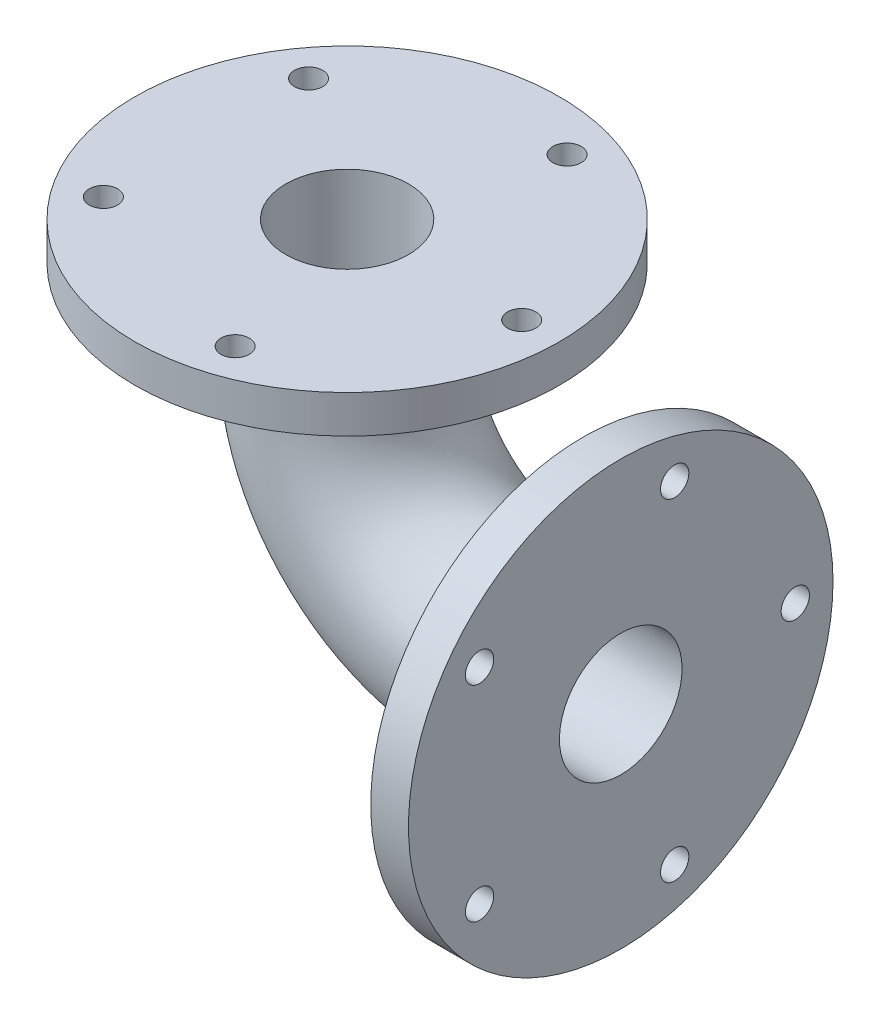
ISO-10303-21;
HEADER;
FILE_DESCRIPTION(('STEP AP214'),'2;1');
FILE_NAME('part.step','',(''),(''),'','','');
FILE_SCHEMA(('AUTOMOTIVE_DESIGN { 1 0 10303 214 1 1 1 1 }'));
ENDSEC;
DATA;
#1=APPLICATION_CONTEXT('core data for automotive mechanical design processes');
#2=APPLICATION_PROTOCOL_DEFINITION('international standard','automotive_design',2000,#1);
#3=PRODUCT_CONTEXT('',#1,'mechanical');
#4=PRODUCT('Part','Part','',(#3));
#5=PRODUCT_RELATED_PRODUCT_CATEGORY('part','',(#4));
#6=PRODUCT_DEFINITION_FORMATION('','',#4);
#7=PRODUCT_DEFINITION_CONTEXT('part definition',#1,'design');
#8=PRODUCT_DEFINITION('design','',#6,#7);
#9=PRODUCT_DEFINITION_SHAPE('','',#8);
#10=(LENGTH_UNIT() NAMED_UNIT(*) SI_UNIT(.MILLI.,.METRE.));
#11=(NAMED_UNIT(*) PLANE_ANGLE_UNIT() SI_UNIT($,.RADIAN.));
#12=(NAMED_UNIT(*) SI_UNIT($,.STERADIAN.) SOLID_ANGLE_UNIT());
#13=UNCERTAINTY_MEASURE_WITH_UNIT(LENGTH_MEASURE(1.E-05),#10,'distance_accuracy_value','');
#14=(GEOMETRIC_REPRESENTATION_CONTEXT(3) GLOBAL_UNCERTAINTY_ASSIGNED_CONTEXT((#13)) GLOBAL_UNIT_ASSIGNED_CONTEXT((#10,
#11,#12)) REPRESENTATION_CONTEXT('',''));
#15=CARTESIAN_POINT('',(0.,0.,0.));
#16=DIRECTION('',(0.,0.,1.));
#17=DIRECTION('',(1.,0.,0.));
#18=AXIS2_PLACEMENT_3D('',#15,#16,#17);
#19=CARTESIAN_POINT('',(-145.,90.,0.));
#20=DIRECTION('',(0.,1.,0.));
#21=DIRECTION('',(0.,0.,1.));
#22=AXIS2_PLACEMENT_3D('',#19,#20,#21);
#23=CYLINDRICAL_SURFACE('',#22,48.5);
#24=CARTESIAN_POINT('',(-145.,90.,0.));
#25=DIRECTION('',(0.,-1.,0.));
#26=DIRECTION('',(0.,0.,-1.));
#27=AXIS2_PLACEMENT_3D('',#24,#25,#26);
#28=CIRCLE('',#27,48.5);
#29=CARTESIAN_POINT('',(-193.5,90.,0.));
#30=VERTEX_POINT('',#29);
#31=EDGE_CURVE('E42',#30,#30,#28,.T.);
#32=ORIENTED_EDGE('',*,*,#31,.F.);
#33=EDGE_LOOP('',(#32));
#34=FACE_BOUND('',#33,.T.);
#35=CARTESIAN_POINT('',(-145.,130.,0.));
#36=DIRECTION('',(0.,1.,0.));
#37=DIRECTION('',(0.,0.,1.));
#38=AXIS2_PLACEMENT_3D('',#35,#36,#37);
#39=CIRCLE('',#38,48.5);
#40=CARTESIAN_POINT('',(-145.,130.,48.5));
#41=VERTEX_POINT('',#40);
#42=EDGE_CURVE('E10',#41,#41,#39,.T.);
#43=ORIENTED_EDGE('',*,*,#42,.F.);
#44=EDGE_LOOP('',(#43));
#45=FACE_BOUND('',#44,.T.);
#46=ADVANCED_FACE('F31',(#34,#45),#23,.T.);
#47=CARTESIAN_POINT('',(0.,0.,0.));
#48=DIRECTION('',(-1.,0.,0.));
#49=DIRECTION('',(0.,0.,1.));
#50=AXIS2_PLACEMENT_3D('',#47,#48,#49);
#51=CYLINDRICAL_SURFACE('',#50,48.5);
#52=CARTESIAN_POINT('',(-55.,0.,0.));
#53=DIRECTION('',(1.,0.,0.));
#54=DIRECTION('',(0.,0.,-1.));
#55=AXIS2_PLACEMENT_3D('',#52,#53,#54);
#56=CIRCLE('',#55,48.5);
#57=CARTESIAN_POINT('',(-55.,-48.5,0.));
#58=VERTEX_POINT('',#57);
#59=EDGE_CURVE('E46',#58,#58,#56,.T.);
#60=ORIENTED_EDGE('',*,*,#59,.T.);
#61=EDGE_LOOP('',(#60));
#62=FACE_BOUND('',#61,.T.);
#63=CARTESIAN_POINT('',(-20.,0.,0.));
#64=DIRECTION('',(1.,0.,0.));
#65=DIRECTION('',(0.,0.,-1.));
#66=AXIS2_PLACEMENT_3D('',#63,#64,#65);
#67=CIRCLE('',#66,48.5);
#68=CARTESIAN_POINT('',(-20.,0.,-48.5));
#69=VERTEX_POINT('',#68);
#70=EDGE_CURVE('E38',#69,#69,#67,.T.);
#71=ORIENTED_EDGE('',*,*,#70,.F.);
#72=EDGE_LOOP('',(#71));
#73=FACE_BOUND('',#72,.T.);
#74=ADVANCED_FACE('F166',(#62,#73),#51,.T.);
#75=CARTESIAN_POINT('',(-55.,90.,0.));
#76=DIRECTION('',(0.,0.,-1.));
#77=DIRECTION('',(-1.,0.,0.));
#78=AXIS2_PLACEMENT_3D('',#75,#76,#77);
#79=TOROIDAL_SURFACE('',#78,90.,48.5);
#80=CARTESIAN_POINT('',(-55.,90.,0.));
#81=DIRECTION('',(0.,0.,-1.));
#82=DIRECTION('',(-1.,0.,0.));
#83=AXIS2_PLACEMENT_3D('',#80,#81,#82);
#84=CIRCLE('',#83,138.5);
#85=EDGE_CURVE('',#58,#30,#84,.T.);
#86=ORIENTED_EDGE('',*,*,#59,.F.);
#87=ORIENTED_EDGE('',*,*,#31,.T.);
#88=ORIENTED_EDGE('',*,*,#85,.T.);
#89=ORIENTED_EDGE('',*,*,#85,.F.);
#90=EDGE_LOOP('',(#86,#88,#87,#89));
#91=FACE_BOUND('',#90,.T.);
#92=ADVANCED_FACE('F157',(#91),#79,.T.);
#93=CARTESIAN_POINT('',(-20.,0.,0.));
#94=DIRECTION('',(1.,0.,0.));
#95=DIRECTION('',(0.,0.,-1.));
#96=AXIS2_PLACEMENT_3D('',#93,#94,#95);
#97=CYLINDRICAL_SURFACE('',#96,112.5);
#98=CARTESIAN_POINT('',(-20.,0.,0.));
#99=DIRECTION('',(1.,0.,0.));
#100=DIRECTION('',(0.,0.,-1.));
#101=AXIS2_PLACEMENT_3D('',#98,#99,#100);
#102=CIRCLE('',#101,112.5);
#103=CARTESIAN_POINT('',(-20.,0.,-112.5));
#104=VERTEX_POINT('',#103);
#105=EDGE_CURVE('E51',#104,#104,#102,.T.);
#106=ORIENTED_EDGE('',*,*,#105,.T.);
#107=EDGE_LOOP('',(#106));
#108=FACE_BOUND('',#107,.T.);
#109=CARTESIAN_POINT('',(0.,0.,0.));
#110=DIRECTION('',(1.,0.,0.));
#111=DIRECTION('',(0.,0.,-1.));
#112=AXIS2_PLACEMENT_3D('',#109,#110,#111);
#113=CIRCLE('',#112,112.5);
#114=CARTESIAN_POINT('',(0.,0.,-112.5));
#115=VERTEX_POINT('',#114);
#116=EDGE_CURVE('E52',#115,#115,#113,.T.);
#117=ORIENTED_EDGE('',*,*,#116,.F.);
#118=EDGE_LOOP('',(#117));
#119=FACE_BOUND('',#118,.T.);
#120=ADVANCED_FACE('F155',(#108,#119),#97,.T.);
#121=CARTESIAN_POINT('',(-20.,0.,0.));
#122=DIRECTION('',(1.,0.,0.));
#123=DIRECTION('',(0.,0.,-1.));
#124=AXIS2_PLACEMENT_3D('',#121,#122,#123);
#125=PLANE('',#124);
#126=CARTESIAN_POINT('',(-20.,-87.9727277573018,-28.5840719796824));
#127=DIRECTION('',(1.,0.,0.));
#128=DIRECTION('',(0.,0.,-1.));
#129=AXIS2_PLACEMENT_3D('',#126,#127,#128);
#130=CIRCLE('',#129,7.50000000000002);
#131=CARTESIAN_POINT('',(-20.,-87.9727277573018,-36.0840719796824));
#132=VERTEX_POINT('',#131);
#133=EDGE_CURVE('E111',#132,#132,#130,.T.);
#134=ORIENTED_EDGE('',*,*,#133,.T.);
#135=EDGE_LOOP('',(#134));
#136=FACE_BOUND('',#135,.T.);
#137=CARTESIAN_POINT('',(-20.,-54.3701358370533,74.8340719796829));
#138=DIRECTION('',(1.,0.,0.));
#139=DIRECTION('',(0.,0.,-1.));
#140=AXIS2_PLACEMENT_3D('',#137,#138,#139);
#141=CIRCLE('',#140,7.50000000000001);
#142=CARTESIAN_POINT('',(-20.,-54.3701358370533,67.3340719796829));
#143=VERTEX_POINT('',#142);
#144=EDGE_CURVE('E114',#143,#143,#141,.T.);
#145=ORIENTED_EDGE('',*,*,#144,.T.);
#146=EDGE_LOOP('',(#145));
#147=FACE_BOUND('',#146,.T.);
#148=CARTESIAN_POINT('',(-20.,54.3701358370544,74.8340719796822));
#149=DIRECTION('',(1.,0.,0.));
#150=DIRECTION('',(0.,0.,-1.));
#151=AXIS2_PLACEMENT_3D('',#148,#149,#150);
#152=CIRCLE('',#151,7.50000000000001);
#153=CARTESIAN_POINT('',(-20.,54.3701358370544,67.3340719796822));
#154=VERTEX_POINT('',#153);
#155=EDGE_CURVE('E117',#154,#154,#152,.T.);
#156=ORIENTED_EDGE('',*,*,#155,.T.);
#157=EDGE_LOOP('',(#156));
#158=FACE_BOUND('',#157,.T.);
#159=CARTESIAN_POINT('',(-20.,87.9727277573014,-28.5840719796836));
#160=DIRECTION('',(1.,0.,0.));
#161=DIRECTION('',(0.,0.,-1.));
#162=AXIS2_PLACEMENT_3D('',#159,#160,#161);
#163=CIRCLE('',#162,7.50000000000001);
#164=CARTESIAN_POINT('',(-20.,87.9727277573014,-36.0840719796836));
#165=VERTEX_POINT('',#164);
#166=EDGE_CURVE('E120',#165,#165,#163,.T.);
#167=ORIENTED_EDGE('',*,*,#166,.T.);
#168=EDGE_LOOP('',(#167));
#169=FACE_BOUND('',#168,.T.);
#170=CARTESIAN_POINT('',(-20.,0.,-92.5));
#171=DIRECTION('',(1.,0.,0.));
#172=DIRECTION('',(0.,0.,-1.));
#173=AXIS2_PLACEMENT_3D('',#170,#171,#172);
#174=CIRCLE('',#173,7.50000000000001);
#175=CARTESIAN_POINT('',(-20.,0.,-100.));
#176=VERTEX_POINT('',#175);
#177=EDGE_CURVE('E98',#176,#176,#174,.T.);
#178=ORIENTED_EDGE('',*,*,#177,.T.);
#179=EDGE_LOOP('',(#178));
#180=FACE_BOUND('',#179,.T.);
#181=ORIENTED_EDGE('',*,*,#70,.T.);
#182=EDGE_LOOP('',(#181));
#183=FACE_BOUND('',#182,.T.);
#184=ORIENTED_EDGE('',*,*,#105,.F.);
#185=EDGE_LOOP('',(#184));
#186=FACE_BOUND('',#185,.T.);
#187=ADVANCED_FACE('F142',(#136,#147,#158,#169,#180,#183,#186),#125,.F.);
#188=CARTESIAN_POINT('',(0.,0.,0.));
#189=DIRECTION('',(1.,0.,0.));
#190=DIRECTION('',(0.,0.,-1.));
#191=AXIS2_PLACEMENT_3D('',#188,#189,#190);
#192=PLANE('',#191);
#193=CARTESIAN_POINT('',(0.,-87.9727277573018,-28.5840719796824));
#194=DIRECTION('',(1.,0.,0.));
#195=DIRECTION('',(0.,0.,-1.));
#196=AXIS2_PLACEMENT_3D('',#193,#194,#195);
#197=CIRCLE('',#196,7.50000000000002);
#198=CARTESIAN_POINT('',(0.,-87.9727277573018,-36.0840719796824));
#199=VERTEX_POINT('',#198);
#200=EDGE_CURVE('E123',#199,#199,#197,.T.);
#201=ORIENTED_EDGE('',*,*,#200,.F.);
#202=EDGE_LOOP('',(#201));
#203=FACE_BOUND('',#202,.T.);
#204=CARTESIAN_POINT('',(0.,-54.3701358370533,74.8340719796829));
#205=DIRECTION('',(1.,0.,0.));
#206=DIRECTION('',(0.,0.,-1.));
#207=AXIS2_PLACEMENT_3D('',#204,#205,#206);
#208=CIRCLE('',#207,7.50000000000001);
#209=CARTESIAN_POINT('',(0.,-54.3701358370533,67.3340719796829));
#210=VERTEX_POINT('',#209);
#211=EDGE_CURVE('E130',#210,#210,#208,.T.);
#212=ORIENTED_EDGE('',*,*,#211,.F.);
#213=EDGE_LOOP('',(#212));
#214=FACE_BOUND('',#213,.T.);
#215=CARTESIAN_POINT('',(0.,54.3701358370544,74.8340719796822));
#216=DIRECTION('',(1.,0.,0.));
#217=DIRECTION('',(0.,0.,-1.));
#218=AXIS2_PLACEMENT_3D('',#215,#216,#217);
#219=CIRCLE('',#218,7.50000000000001);
#220=CARTESIAN_POINT('',(0.,54.3701358370544,67.3340719796822));
#221=VERTEX_POINT('',#220);
#222=EDGE_CURVE('E127',#221,#221,#219,.T.);
#223=ORIENTED_EDGE('',*,*,#222,.F.);
#224=EDGE_LOOP('',(#223));
#225=FACE_BOUND('',#224,.T.);
#226=CARTESIAN_POINT('',(0.,87.9727277573014,-28.5840719796836));
#227=DIRECTION('',(1.,0.,0.));
#228=DIRECTION('',(0.,0.,-1.));
#229=AXIS2_PLACEMENT_3D('',#226,#227,#228);
#230=CIRCLE('',#229,7.50000000000001);
#231=CARTESIAN_POINT('',(0.,87.9727277573014,-36.0840719796836));
#232=VERTEX_POINT('',#231);
#233=EDGE_CURVE('E124',#232,#232,#230,.T.);
#234=ORIENTED_EDGE('',*,*,#233,.F.);
#235=EDGE_LOOP('',(#234));
#236=FACE_BOUND('',#235,.T.);
#237=CARTESIAN_POINT('',(0.,0.,-92.5));
#238=DIRECTION('',(1.,0.,0.));
#239=DIRECTION('',(0.,0.,-1.));
#240=AXIS2_PLACEMENT_3D('',#237,#238,#239);
#241=CIRCLE('',#240,7.50000000000001);
#242=CARTESIAN_POINT('',(0.,0.,-100.));
#243=VERTEX_POINT('',#242);
#244=EDGE_CURVE('E108',#243,#243,#241,.T.);
#245=ORIENTED_EDGE('',*,*,#244,.F.);
#246=EDGE_LOOP('',(#245));
#247=FACE_BOUND('',#246,.T.);
#248=CARTESIAN_POINT('',(0.,0.,0.));
#249=DIRECTION('',(1.,0.,0.));
#250=DIRECTION('',(0.,0.,-1.));
#251=AXIS2_PLACEMENT_3D('',#248,#249,#250);
#252=CIRCLE('',#251,32.5);
#253=CARTESIAN_POINT('',(0.,0.,-32.5));
#254=VERTEX_POINT('',#253);
#255=EDGE_CURVE('E66',#254,#254,#252,.T.);
#256=ORIENTED_EDGE('',*,*,#255,.F.);
#257=EDGE_LOOP('',(#256));
#258=FACE_BOUND('',#257,.T.);
#259=ORIENTED_EDGE('',*,*,#116,.T.);
#260=EDGE_LOOP('',(#259));
#261=FACE_BOUND('',#260,.T.);
#262=ADVANCED_FACE('F33',(#203,#214,#225,#236,#247,#258,#261),#192,.T.);
#263=CARTESIAN_POINT('',(-145.,130.,0.));
#264=DIRECTION('',(0.,1.,0.));
#265=DIRECTION('',(0.,0.,1.));
#266=AXIS2_PLACEMENT_3D('',#263,#264,#265);
#267=CYLINDRICAL_SURFACE('',#266,112.5);
#268=CARTESIAN_POINT('',(-145.,130.,0.));
#269=DIRECTION('',(0.,1.,0.));
#270=DIRECTION('',(0.,0.,1.));
#271=AXIS2_PLACEMENT_3D('',#268,#269,#270);
#272=CIRCLE('',#271,112.5);
#273=CARTESIAN_POINT('',(-145.,130.,112.5));
#274=VERTEX_POINT('',#273);
#275=EDGE_CURVE('E55',#274,#274,#272,.T.);
#276=ORIENTED_EDGE('',*,*,#275,.T.);
#277=EDGE_LOOP('',(#276));
#278=FACE_BOUND('',#277,.T.);
#279=CARTESIAN_POINT('',(-145.,150.,0.));
#280=DIRECTION('',(0.,1.,0.));
#281=DIRECTION('',(0.,0.,1.));
#282=AXIS2_PLACEMENT_3D('',#279,#280,#281);
#283=CIRCLE('',#282,112.5);
#284=CARTESIAN_POINT('',(-145.,150.,112.5));
#285=VERTEX_POINT('',#284);
#286=EDGE_CURVE('E58',#285,#285,#283,.T.);
#287=ORIENTED_EDGE('',*,*,#286,.F.);
#288=EDGE_LOOP('',(#287));
#289=FACE_BOUND('',#288,.T.);
#290=ADVANCED_FACE('F141',(#278,#289),#267,.T.);
#291=CARTESIAN_POINT('',(-145.,130.,0.));
#292=DIRECTION('',(0.,1.,0.));
#293=DIRECTION('',(0.,0.,1.));
#294=AXIS2_PLACEMENT_3D('',#291,#292,#293);
#295=PLANE('',#294);
#296=CARTESIAN_POINT('',(-116.415928020316,130.,-87.9727277573014));
#297=DIRECTION('',(0.,1.,0.));
#298=DIRECTION('',(0.,0.,1.));
#299=AXIS2_PLACEMENT_3D('',#296,#297,#298);
#300=CIRCLE('',#299,7.49999999999999);
#301=CARTESIAN_POINT('',(-116.415928020316,130.,-80.4727277573014));
#302=VERTEX_POINT('',#301);
#303=EDGE_CURVE('E81',#302,#302,#300,.T.);
#304=ORIENTED_EDGE('',*,*,#303,.T.);
#305=EDGE_LOOP('',(#304));
#306=FACE_BOUND('',#305,.T.);
#307=CARTESIAN_POINT('',(-52.5,130.,0.));
#308=DIRECTION('',(0.,1.,0.));
#309=DIRECTION('',(0.,0.,1.));
#310=AXIS2_PLACEMENT_3D('',#307,#308,#309);
#311=CIRCLE('',#310,7.5);
#312=CARTESIAN_POINT('',(-52.5,130.,7.5));
#313=VERTEX_POINT('',#312);
#314=EDGE_CURVE('E84',#313,#313,#311,.T.);
#315=ORIENTED_EDGE('',*,*,#314,.T.);
#316=EDGE_LOOP('',(#315));
#317=FACE_BOUND('',#316,.T.);
#318=CARTESIAN_POINT('',(-116.415928020318,130.,87.9727277573018));
#319=DIRECTION('',(0.,1.,0.));
#320=DIRECTION('',(0.,0.,1.));
#321=AXIS2_PLACEMENT_3D('',#318,#319,#320);
#322=CIRCLE('',#321,7.50000000000001);
#323=CARTESIAN_POINT('',(-116.415928020318,130.,95.4727277573018));
#324=VERTEX_POINT('',#323);
#325=EDGE_CURVE('E87',#324,#324,#322,.T.);
#326=ORIENTED_EDGE('',*,*,#325,.T.);
#327=EDGE_LOOP('',(#326));
#328=FACE_BOUND('',#327,.T.);
#329=CARTESIAN_POINT('',(-219.834071979683,130.,54.3701358370533));
#330=DIRECTION('',(0.,1.,0.));
#331=DIRECTION('',(0.,0.,1.));
#332=AXIS2_PLACEMENT_3D('',#329,#330,#331);
#333=CIRCLE('',#332,7.5);
#334=CARTESIAN_POINT('',(-219.834071979683,130.,61.8701358370533));
#335=VERTEX_POINT('',#334);
#336=EDGE_CURVE('E90',#335,#335,#333,.T.);
#337=ORIENTED_EDGE('',*,*,#336,.T.);
#338=EDGE_LOOP('',(#337));
#339=FACE_BOUND('',#338,.T.);
#340=CARTESIAN_POINT('',(-219.834071979682,130.,-54.3701358370544));
#341=DIRECTION('',(0.,1.,0.));
#342=DIRECTION('',(0.,0.,1.));
#343=AXIS2_PLACEMENT_3D('',#340,#341,#342);
#344=CIRCLE('',#343,7.50000000000002);
#345=CARTESIAN_POINT('',(-219.834071979682,130.,-46.8701358370544));
#346=VERTEX_POINT('',#345);
#347=EDGE_CURVE('E73',#346,#346,#344,.T.);
#348=ORIENTED_EDGE('',*,*,#347,.T.);
#349=EDGE_LOOP('',(#348));
#350=FACE_BOUND('',#349,.T.);
#351=ORIENTED_EDGE('',*,*,#42,.T.);
#352=EDGE_LOOP('',(#351));
#353=FACE_BOUND('',#352,.T.);
#354=ORIENTED_EDGE('',*,*,#275,.F.);
#355=EDGE_LOOP('',(#354));
#356=FACE_BOUND('',#355,.T.);
#357=ADVANCED_FACE('F182',(#306,#317,#328,#339,#350,#353,#356),#295,.F.);
#358=CARTESIAN_POINT('',(-145.,150.,0.));
#359=DIRECTION('',(0.,-1.,0.));
#360=DIRECTION('',(0.,0.,-1.));
#361=AXIS2_PLACEMENT_3D('',#358,#359,#360);
#362=PLANE('',#361);
#363=CARTESIAN_POINT('',(-116.415928020316,150.,-87.9727277573014));
#364=DIRECTION('',(0.,1.,0.));
#365=DIRECTION('',(0.,0.,1.));
#366=AXIS2_PLACEMENT_3D('',#363,#364,#365);
#367=CIRCLE('',#366,7.49999999999999);
#368=CARTESIAN_POINT('',(-116.415928020316,150.,-80.4727277573014));
#369=VERTEX_POINT('',#368);
#370=EDGE_CURVE('E93',#369,#369,#367,.T.);
#371=ORIENTED_EDGE('',*,*,#370,.F.);
#372=EDGE_LOOP('',(#371));
#373=FACE_BOUND('',#372,.T.);
#374=CARTESIAN_POINT('',(-52.5,150.,0.));
#375=DIRECTION('',(0.,1.,0.));
#376=DIRECTION('',(0.,0.,1.));
#377=AXIS2_PLACEMENT_3D('',#374,#375,#376);
#378=CIRCLE('',#377,7.5);
#379=CARTESIAN_POINT('',(-52.5,150.,7.5));
#380=VERTEX_POINT('',#379);
#381=EDGE_CURVE('E101',#380,#380,#378,.T.);
#382=ORIENTED_EDGE('',*,*,#381,.F.);
#383=EDGE_LOOP('',(#382));
#384=FACE_BOUND('',#383,.T.);
#385=CARTESIAN_POINT('',(-116.415928020318,150.,87.9727277573018));
#386=DIRECTION('',(0.,1.,0.));
#387=DIRECTION('',(0.,0.,1.));
#388=AXIS2_PLACEMENT_3D('',#385,#386,#387);
#389=CIRCLE('',#388,7.50000000000001);
#390=CARTESIAN_POINT('',(-116.415928020318,150.,95.4727277573018));
#391=VERTEX_POINT('',#390);
#392=EDGE_CURVE('E97',#391,#391,#389,.T.);
#393=ORIENTED_EDGE('',*,*,#392,.F.);
#394=EDGE_LOOP('',(#393));
#395=FACE_BOUND('',#394,.T.);
#396=CARTESIAN_POINT('',(-219.834071979683,150.,54.3701358370533));
#397=DIRECTION('',(0.,1.,0.));
#398=DIRECTION('',(0.,0.,1.));
#399=AXIS2_PLACEMENT_3D('',#396,#397,#398);
#400=CIRCLE('',#399,7.5);
#401=CARTESIAN_POINT('',(-219.834071979683,150.,61.8701358370533));
#402=VERTEX_POINT('',#401);
#403=EDGE_CURVE('E94',#402,#402,#400,.T.);
#404=ORIENTED_EDGE('',*,*,#403,.F.);
#405=EDGE_LOOP('',(#404));
#406=FACE_BOUND('',#405,.T.);
#407=CARTESIAN_POINT('',(-219.834071979682,150.,-54.3701358370544));
#408=DIRECTION('',(0.,1.,0.));
#409=DIRECTION('',(0.,0.,1.));
#410=AXIS2_PLACEMENT_3D('',#407,#408,#409);
#411=CIRCLE('',#410,7.50000000000002);
#412=CARTESIAN_POINT('',(-219.834071979682,150.,-46.8701358370544));
#413=VERTEX_POINT('',#412);
#414=EDGE_CURVE('E78',#413,#413,#411,.T.);
#415=ORIENTED_EDGE('',*,*,#414,.F.);
#416=EDGE_LOOP('',(#415));
#417=FACE_BOUND('',#416,.T.);
#418=CARTESIAN_POINT('',(-145.,150.,0.));
#419=DIRECTION('',(0.,-1.,0.));
#420=DIRECTION('',(0.,0.,-1.));
#421=AXIS2_PLACEMENT_3D('',#418,#419,#420);
#422=CIRCLE('',#421,32.5);
#423=CARTESIAN_POINT('',(-145.,150.,-32.5));
#424=VERTEX_POINT('',#423);
#425=EDGE_CURVE('E61',#424,#424,#422,.T.);
#426=ORIENTED_EDGE('',*,*,#425,.T.);
#427=EDGE_LOOP('',(#426));
#428=FACE_BOUND('',#427,.T.);
#429=ORIENTED_EDGE('',*,*,#286,.T.);
#430=EDGE_LOOP('',(#429));
#431=FACE_BOUND('',#430,.T.);
#432=ADVANCED_FACE('F179',(#373,#384,#395,#406,#417,#428,#431),#362,.F.);
#433=CARTESIAN_POINT('',(5.,0.,0.));
#434=DIRECTION('',(-1.,0.,0.));
#435=DIRECTION('',(0.,0.,1.));
#436=AXIS2_PLACEMENT_3D('',#433,#434,#435);
#437=CYLINDRICAL_SURFACE('',#436,32.5);
#438=CARTESIAN_POINT('',(-55.,0.,0.));
#439=DIRECTION('',(1.,0.,0.));
#440=DIRECTION('',(0.,0.,-1.));
#441=AXIS2_PLACEMENT_3D('',#438,#439,#440);
#442=CIRCLE('',#441,32.5);
#443=CARTESIAN_POINT('',(-55.,-32.5,0.));
#444=VERTEX_POINT('',#443);
#445=EDGE_CURVE('E70',#444,#444,#442,.T.);
#446=ORIENTED_EDGE('',*,*,#445,.F.);
#447=EDGE_LOOP('',(#446));
#448=FACE_BOUND('',#447,.T.);
#449=ORIENTED_EDGE('',*,*,#255,.T.);
#450=EDGE_LOOP('',(#449));
#451=FACE_BOUND('',#450,.T.);
#452=ADVANCED_FACE('F181',(#448,#451),#437,.F.);
#453=CARTESIAN_POINT('',(-55.,90.,0.));
#454=DIRECTION('',(0.,0.,-1.));
#455=DIRECTION('',(-1.,0.,0.));
#456=AXIS2_PLACEMENT_3D('',#453,#454,#455);
#457=TOROIDAL_SURFACE('',#456,90.,32.5);
#458=CARTESIAN_POINT('',(-145.,90.,0.));
#459=DIRECTION('',(0.,-1.,0.));
#460=DIRECTION('',(0.,0.,-1.));
#461=AXIS2_PLACEMENT_3D('',#458,#459,#460);
#462=CIRCLE('',#461,32.5);
#463=CARTESIAN_POINT('',(-177.5,90.,0.));
#464=VERTEX_POINT('',#463);
#465=EDGE_CURVE('E69',#464,#464,#462,.T.);
#466=CARTESIAN_POINT('',(-55.,90.,0.));
#467=DIRECTION('',(0.,0.,-1.));
#468=DIRECTION('',(-1.,0.,0.));
#469=AXIS2_PLACEMENT_3D('',#466,#467,#468);
#470=CIRCLE('',#469,122.5);
#471=EDGE_CURVE('',#444,#464,#470,.T.);
#472=ORIENTED_EDGE('',*,*,#445,.T.);
#473=ORIENTED_EDGE('',*,*,#465,.F.);
#474=ORIENTED_EDGE('',*,*,#471,.T.);
#475=ORIENTED_EDGE('',*,*,#471,.F.);
#476=EDGE_LOOP('',(#472,#474,#473,#475));
#477=FACE_BOUND('',#476,.T.);
#478=ADVANCED_FACE('F188',(#477),#457,.F.);
#479=CARTESIAN_POINT('',(-145.,90.,0.));
#480=DIRECTION('',(0.,1.,0.));
#481=DIRECTION('',(0.,0.,1.));
#482=AXIS2_PLACEMENT_3D('',#479,#480,#481);
#483=CYLINDRICAL_SURFACE('',#482,32.5);
#484=ORIENTED_EDGE('',*,*,#425,.F.);
#485=EDGE_LOOP('',(#484));
#486=FACE_BOUND('',#485,.T.);
#487=ORIENTED_EDGE('',*,*,#465,.T.);
#488=EDGE_LOOP('',(#487));
#489=FACE_BOUND('',#488,.T.);
#490=ADVANCED_FACE('F191',(#486,#489),#483,.F.);
#491=CARTESIAN_POINT('',(-219.834071979682,120.,-54.3701358370544));
#492=DIRECTION('',(0.,1.,0.));
#493=DIRECTION('',(0.,0.,1.));
#494=AXIS2_PLACEMENT_3D('',#491,#492,#493);
#495=CYLINDRICAL_SURFACE('',#494,7.50000000000002);
#496=ORIENTED_EDGE('',*,*,#414,.T.);
#497=EDGE_LOOP('',(#496));
#498=FACE_BOUND('',#497,.T.);
#499=ORIENTED_EDGE('',*,*,#347,.F.);
#500=EDGE_LOOP('',(#499));
#501=FACE_BOUND('',#500,.T.);
#502=ADVANCED_FACE('F217',(#498,#501),#495,.F.);
#503=CARTESIAN_POINT('',(-219.834071979683,120.,54.3701358370533));
#504=DIRECTION('',(0.,1.,0.));
#505=DIRECTION('',(0.,0.,1.));
#506=AXIS2_PLACEMENT_3D('',#503,#504,#505);
#507=CYLINDRICAL_SURFACE('',#506,7.5);
#508=ORIENTED_EDGE('',*,*,#403,.T.);
#509=EDGE_LOOP('',(#508));
#510=FACE_BOUND('',#509,.T.);
#511=ORIENTED_EDGE('',*,*,#336,.F.);
#512=EDGE_LOOP('',(#511));
#513=FACE_BOUND('',#512,.T.);
#514=ADVANCED_FACE('F223',(#510,#513),#507,.F.);
#515=CARTESIAN_POINT('',(-116.415928020318,120.,87.9727277573018));
#516=DIRECTION('',(0.,1.,0.));
#517=DIRECTION('',(0.,0.,1.));
#518=AXIS2_PLACEMENT_3D('',#515,#516,#517);
#519=CYLINDRICAL_SURFACE('',#518,7.50000000000001);
#520=ORIENTED_EDGE('',*,*,#392,.T.);
#521=EDGE_LOOP('',(#520));
#522=FACE_BOUND('',#521,.T.);
#523=ORIENTED_EDGE('',*,*,#325,.F.);
#524=EDGE_LOOP('',(#523));
#525=FACE_BOUND('',#524,.T.);
#526=ADVANCED_FACE('F227',(#522,#525),#519,.F.);
#527=CARTESIAN_POINT('',(-52.5,120.,0.));
#528=DIRECTION('',(0.,1.,0.));
#529=DIRECTION('',(0.,0.,1.));
#530=AXIS2_PLACEMENT_3D('',#527,#528,#529);
#531=CYLINDRICAL_SURFACE('',#530,7.5);
#532=ORIENTED_EDGE('',*,*,#381,.T.);
#533=EDGE_LOOP('',(#532));
#534=FACE_BOUND('',#533,.T.);
#535=ORIENTED_EDGE('',*,*,#314,.F.);
#536=EDGE_LOOP('',(#535));
#537=FACE_BOUND('',#536,.T.);
#538=ADVANCED_FACE('F231',(#534,#537),#531,.F.);
#539=CARTESIAN_POINT('',(-116.415928020316,120.,-87.9727277573014));
#540=DIRECTION('',(0.,1.,0.));
#541=DIRECTION('',(0.,0.,1.));
#542=AXIS2_PLACEMENT_3D('',#539,#540,#541);
#543=CYLINDRICAL_SURFACE('',#542,7.49999999999999);
#544=ORIENTED_EDGE('',*,*,#370,.T.);
#545=EDGE_LOOP('',(#544));
#546=FACE_BOUND('',#545,.T.);
#547=ORIENTED_EDGE('',*,*,#303,.F.);
#548=EDGE_LOOP('',(#547));
#549=FACE_BOUND('',#548,.T.);
#550=ADVANCED_FACE('F235',(#546,#549),#543,.F.);
#551=CARTESIAN_POINT('',(-30.,0.,-92.5));
#552=DIRECTION('',(1.,0.,0.));
#553=DIRECTION('',(0.,0.,-1.));
#554=AXIS2_PLACEMENT_3D('',#551,#552,#553);
#555=CYLINDRICAL_SURFACE('',#554,7.50000000000001);
#556=ORIENTED_EDGE('',*,*,#244,.T.);
#557=EDGE_LOOP('',(#556));
#558=FACE_BOUND('',#557,.T.);
#559=ORIENTED_EDGE('',*,*,#177,.F.);
#560=EDGE_LOOP('',(#559));
#561=FACE_BOUND('',#560,.T.);
#562=ADVANCED_FACE('F239',(#558,#561),#555,.F.);
#563=CARTESIAN_POINT('',(-30.,87.9727277573014,-28.5840719796836));
#564=DIRECTION('',(1.,0.,0.));
#565=DIRECTION('',(0.,0.,-1.));
#566=AXIS2_PLACEMENT_3D('',#563,#564,#565);
#567=CYLINDRICAL_SURFACE('',#566,7.50000000000001);
#568=ORIENTED_EDGE('',*,*,#233,.T.);
#569=EDGE_LOOP('',(#568));
#570=FACE_BOUND('',#569,.T.);
#571=ORIENTED_EDGE('',*,*,#166,.F.);
#572=EDGE_LOOP('',(#571));
#573=FACE_BOUND('',#572,.T.);
#574=ADVANCED_FACE('F243',(#570,#573),#567,.F.);
#575=CARTESIAN_POINT('',(-30.,54.3701358370544,74.8340719796822));
#576=DIRECTION('',(1.,0.,0.));
#577=DIRECTION('',(0.,0.,-1.));
#578=AXIS2_PLACEMENT_3D('',#575,#576,#577);
#579=CYLINDRICAL_SURFACE('',#578,7.50000000000001);
#580=ORIENTED_EDGE('',*,*,#222,.T.);
#581=EDGE_LOOP('',(#580));
#582=FACE_BOUND('',#581,.T.);
#583=ORIENTED_EDGE('',*,*,#155,.F.);
#584=EDGE_LOOP('',(#583));
#585=FACE_BOUND('',#584,.T.);
#586=ADVANCED_FACE('F247',(#582,#585),#579,.F.);
#587=CARTESIAN_POINT('',(-30.,-54.3701358370533,74.8340719796829));
#588=DIRECTION('',(1.,0.,0.));
#589=DIRECTION('',(0.,0.,-1.));
#590=AXIS2_PLACEMENT_3D('',#587,#588,#589);
#591=CYLINDRICAL_SURFACE('',#590,7.50000000000001);
#592=ORIENTED_EDGE('',*,*,#211,.T.);
#593=EDGE_LOOP('',(#592));
#594=FACE_BOUND('',#593,.T.);
#595=ORIENTED_EDGE('',*,*,#144,.F.);
#596=EDGE_LOOP('',(#595));
#597=FACE_BOUND('',#596,.T.);
#598=ADVANCED_FACE('F251',(#594,#597),#591,.F.);
#599=CARTESIAN_POINT('',(-30.,-87.9727277573018,-28.5840719796824));
#600=DIRECTION('',(1.,0.,0.));
#601=DIRECTION('',(0.,0.,-1.));
#602=AXIS2_PLACEMENT_3D('',#599,#600,#601);
#603=CYLINDRICAL_SURFACE('',#602,7.50000000000002);
#604=ORIENTED_EDGE('',*,*,#200,.T.);
#605=EDGE_LOOP('',(#604));
#606=FACE_BOUND('',#605,.T.);
#607=ORIENTED_EDGE('',*,*,#133,.F.);
#608=EDGE_LOOP('',(#607));
#609=FACE_BOUND('',#608,.T.);
#610=ADVANCED_FACE('F136',(#606,#609),#603,.F.);
#611=CLOSED_SHELL('',(#46,#74,#92,#120,#187,#262,#290,#357,#432,#452,#478,#490,#502,#514,#526,
#538,#550,#562,#574,#586,#598,#610));
#612=MANIFOLD_SOLID_BREP('B2',#611);
#613=ADVANCED_BREP_SHAPE_REPRESENTATION('',(#18,#612),#14);
#614=SHAPE_DEFINITION_REPRESENTATION(#9,#613);
ENDSEC;
END-ISO-10303-21;
